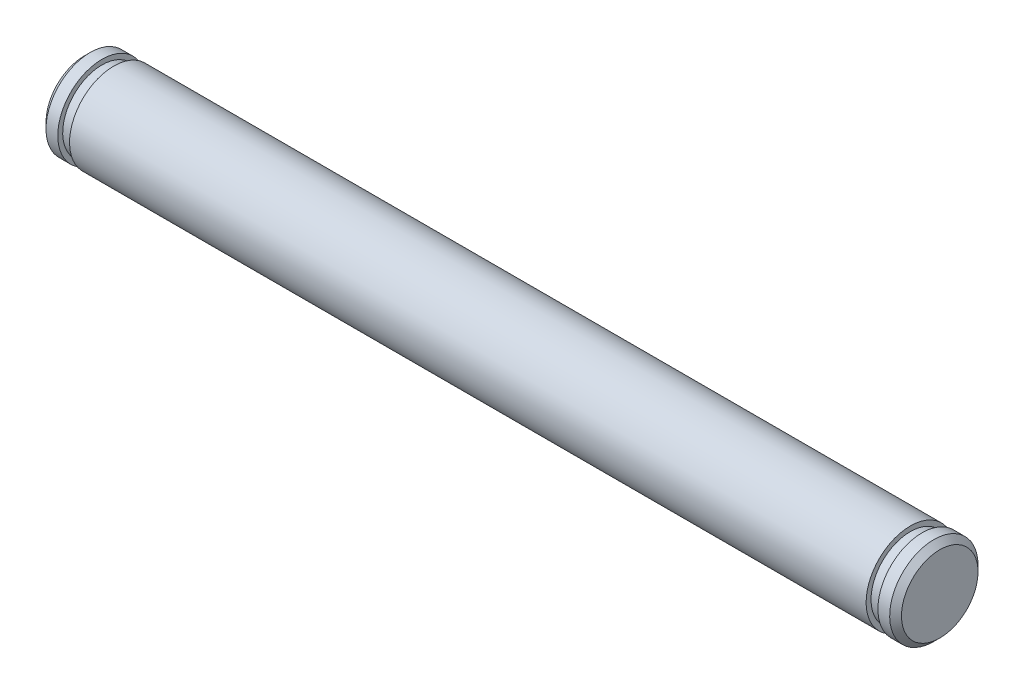
ISO-10303-21;
HEADER;
FILE_DESCRIPTION(('STEP AP214'),'2;1');
FILE_NAME('part.step','',(''),(''),'','','');
FILE_SCHEMA(('AUTOMOTIVE_DESIGN { 1 0 10303 214 1 1 1 1 }'));
ENDSEC;
DATA;
#1=APPLICATION_CONTEXT('core data for automotive mechanical design processes');
#2=APPLICATION_PROTOCOL_DEFINITION('international standard','automotive_design',2000,#1);
#3=PRODUCT_CONTEXT('',#1,'mechanical');
#4=PRODUCT('Part','Part','',(#3));
#5=PRODUCT_RELATED_PRODUCT_CATEGORY('part','',(#4));
#6=PRODUCT_DEFINITION_FORMATION('','',#4);
#7=PRODUCT_DEFINITION_CONTEXT('part definition',#1,'design');
#8=PRODUCT_DEFINITION('design','',#6,#7);
#9=PRODUCT_DEFINITION_SHAPE('','',#8);
#10=(LENGTH_UNIT() NAMED_UNIT(*) SI_UNIT(.MILLI.,.METRE.));
#11=(NAMED_UNIT(*) PLANE_ANGLE_UNIT() SI_UNIT($,.RADIAN.));
#12=(NAMED_UNIT(*) SI_UNIT($,.STERADIAN.) SOLID_ANGLE_UNIT());
#13=UNCERTAINTY_MEASURE_WITH_UNIT(LENGTH_MEASURE(1.E-05),#10,'distance_accuracy_value','');
#14=(GEOMETRIC_REPRESENTATION_CONTEXT(3) GLOBAL_UNCERTAINTY_ASSIGNED_CONTEXT((#13)) GLOBAL_UNIT_ASSIGNED_CONTEXT((#10,
#11,#12)) REPRESENTATION_CONTEXT('',''));
#15=CARTESIAN_POINT('',(0.,0.,0.));
#16=DIRECTION('',(0.,0.,1.));
#17=DIRECTION('',(1.,0.,0.));
#18=AXIS2_PLACEMENT_3D('',#15,#16,#17);
#19=CARTESIAN_POINT('',(-2.,0.,0.));
#20=DIRECTION('',(-1.,0.,0.));
#21=DIRECTION('',(0.,-1.,0.));
#22=AXIS2_PLACEMENT_3D('',#19,#20,#21);
#23=PLANE('',#22);
#24=CARTESIAN_POINT('',(-2.,0.,0.));
#25=DIRECTION('',(-1.,0.,0.));
#26=DIRECTION('',(0.,-1.,0.));
#27=AXIS2_PLACEMENT_3D('',#24,#25,#26);
#28=CIRCLE('',#27,2.59999999999998);
#29=CARTESIAN_POINT('',(-2.,-2.59999999999998,0.));
#30=VERTEX_POINT('',#29);
#31=EDGE_CURVE('E56',#30,#30,#28,.T.);
#32=ORIENTED_EDGE('',*,*,#31,.T.);
#33=EDGE_LOOP('',(#32));
#34=FACE_BOUND('',#33,.T.);
#35=ADVANCED_FACE('F45',(#34),#23,.T.);
#36=CARTESIAN_POINT('',(-2.,0.,0.));
#37=DIRECTION('',(1.,0.,0.));
#38=DIRECTION('',(0.,1.,0.));
#39=AXIS2_PLACEMENT_3D('',#36,#37,#38);
#40=CYLINDRICAL_SURFACE('',#39,3.);
#41=CARTESIAN_POINT('',(-1.59999999999999,0.,0.));
#42=DIRECTION('',(-1.,0.,0.));
#43=DIRECTION('',(0.,-1.,0.));
#44=AXIS2_PLACEMENT_3D('',#41,#42,#43);
#45=CIRCLE('',#44,3.);
#46=CARTESIAN_POINT('',(-1.59999999999999,-3.,0.));
#47=VERTEX_POINT('',#46);
#48=EDGE_CURVE('E60',#47,#47,#45,.F.);
#49=ORIENTED_EDGE('',*,*,#48,.T.);
#50=EDGE_LOOP('',(#49));
#51=FACE_BOUND('',#50,.T.);
#52=CARTESIAN_POINT('',(-0.800000000000001,0.,0.));
#53=DIRECTION('',(1.,0.,0.));
#54=DIRECTION('',(0.,1.,0.));
#55=AXIS2_PLACEMENT_3D('',#52,#53,#54);
#56=CIRCLE('',#55,3.);
#57=CARTESIAN_POINT('',(-0.800000000000001,3.,0.));
#58=VERTEX_POINT('',#57);
#59=EDGE_CURVE('E65',#58,#58,#56,.T.);
#60=ORIENTED_EDGE('',*,*,#59,.F.);
#61=EDGE_LOOP('',(#60));
#62=FACE_BOUND('',#61,.T.);
#63=ADVANCED_FACE('F107',(#51,#62),#40,.T.);
#64=CARTESIAN_POINT('',(-0.800000000000001,3.,0.));
#65=DIRECTION('',(1.,0.,0.));
#66=DIRECTION('',(0.,1.,0.));
#67=AXIS2_PLACEMENT_3D('',#64,#65,#66);
#68=PLANE('',#67);
#69=ORIENTED_EDGE('',*,*,#59,.T.);
#70=EDGE_LOOP('',(#69));
#71=FACE_BOUND('',#70,.T.);
#72=CARTESIAN_POINT('',(-0.800000000000001,0.,0.));
#73=DIRECTION('',(1.,0.,0.));
#74=DIRECTION('',(0.,1.,0.));
#75=AXIS2_PLACEMENT_3D('',#72,#73,#74);
#76=CIRCLE('',#75,2.667);
#77=CARTESIAN_POINT('',(-0.800000000000001,2.667,0.));
#78=VERTEX_POINT('',#77);
#79=EDGE_CURVE('E68',#78,#78,#76,.T.);
#80=ORIENTED_EDGE('',*,*,#79,.F.);
#81=EDGE_LOOP('',(#80));
#82=FACE_BOUND('',#81,.T.);
#83=ADVANCED_FACE('F113',(#71,#82),#68,.T.);
#84=CARTESIAN_POINT('',(-2.,0.,0.));
#85=DIRECTION('',(1.,0.,0.));
#86=DIRECTION('',(0.,1.,0.));
#87=AXIS2_PLACEMENT_3D('',#84,#85,#86);
#88=CYLINDRICAL_SURFACE('',#87,2.667);
#89=ORIENTED_EDGE('',*,*,#79,.T.);
#90=EDGE_LOOP('',(#89));
#91=FACE_BOUND('',#90,.T.);
#92=CARTESIAN_POINT('',(0.,0.,0.));
#93=DIRECTION('',(1.,0.,0.));
#94=DIRECTION('',(0.,1.,0.));
#95=AXIS2_PLACEMENT_3D('',#92,#93,#94);
#96=CIRCLE('',#95,2.667);
#97=CARTESIAN_POINT('',(0.,2.667,0.));
#98=VERTEX_POINT('',#97);
#99=EDGE_CURVE('E71',#98,#98,#96,.T.);
#100=ORIENTED_EDGE('',*,*,#99,.F.);
#101=EDGE_LOOP('',(#100));
#102=FACE_BOUND('',#101,.T.);
#103=ADVANCED_FACE('F134',(#91,#102),#88,.T.);
#104=CARTESIAN_POINT('',(0.,3.,0.));
#105=DIRECTION('',(-1.,0.,0.));
#106=DIRECTION('',(0.,-1.,0.));
#107=AXIS2_PLACEMENT_3D('',#104,#105,#106);
#108=PLANE('',#107);
#109=ORIENTED_EDGE('',*,*,#99,.T.);
#110=EDGE_LOOP('',(#109));
#111=FACE_BOUND('',#110,.T.);
#112=CARTESIAN_POINT('',(0.,0.,0.));
#113=DIRECTION('',(1.,0.,0.));
#114=DIRECTION('',(0.,1.,0.));
#115=AXIS2_PLACEMENT_3D('',#112,#113,#114);
#116=CIRCLE('',#115,3.);
#117=CARTESIAN_POINT('',(0.,3.,0.));
#118=VERTEX_POINT('',#117);
#119=EDGE_CURVE('E74',#118,#118,#116,.T.);
#120=ORIENTED_EDGE('',*,*,#119,.F.);
#121=EDGE_LOOP('',(#120));
#122=FACE_BOUND('',#121,.T.);
#123=ADVANCED_FACE('F139',(#111,#122),#108,.T.);
#124=CARTESIAN_POINT('',(-2.,0.,0.));
#125=DIRECTION('',(1.,0.,0.));
#126=DIRECTION('',(0.,1.,0.));
#127=AXIS2_PLACEMENT_3D('',#124,#125,#126);
#128=CYLINDRICAL_SURFACE('',#127,3.);
#129=ORIENTED_EDGE('',*,*,#119,.T.);
#130=EDGE_LOOP('',(#129));
#131=FACE_BOUND('',#130,.T.);
#132=CARTESIAN_POINT('',(54.102,0.,0.));
#133=DIRECTION('',(1.,0.,0.));
#134=DIRECTION('',(0.,1.,0.));
#135=AXIS2_PLACEMENT_3D('',#132,#133,#134);
#136=CIRCLE('',#135,3.);
#137=CARTESIAN_POINT('',(54.102,3.,0.));
#138=VERTEX_POINT('',#137);
#139=EDGE_CURVE('E77',#138,#138,#136,.T.);
#140=ORIENTED_EDGE('',*,*,#139,.F.);
#141=EDGE_LOOP('',(#140));
#142=FACE_BOUND('',#141,.T.);
#143=ADVANCED_FACE('F145',(#131,#142),#128,.T.);
#144=CARTESIAN_POINT('',(54.102,3.,0.));
#145=DIRECTION('',(1.,0.,0.));
#146=DIRECTION('',(0.,1.,0.));
#147=AXIS2_PLACEMENT_3D('',#144,#145,#146);
#148=PLANE('',#147);
#149=ORIENTED_EDGE('',*,*,#139,.T.);
#150=EDGE_LOOP('',(#149));
#151=FACE_BOUND('',#150,.T.);
#152=CARTESIAN_POINT('',(54.102,0.,0.));
#153=DIRECTION('',(1.,0.,0.));
#154=DIRECTION('',(0.,1.,0.));
#155=AXIS2_PLACEMENT_3D('',#152,#153,#154);
#156=CIRCLE('',#155,2.667);
#157=CARTESIAN_POINT('',(54.102,2.667,0.));
#158=VERTEX_POINT('',#157);
#159=EDGE_CURVE('E80',#158,#158,#156,.T.);
#160=ORIENTED_EDGE('',*,*,#159,.F.);
#161=EDGE_LOOP('',(#160));
#162=FACE_BOUND('',#161,.T.);
#163=ADVANCED_FACE('F103',(#151,#162),#148,.T.);
#164=CARTESIAN_POINT('',(-2.,0.,0.));
#165=DIRECTION('',(1.,0.,0.));
#166=DIRECTION('',(0.,1.,0.));
#167=AXIS2_PLACEMENT_3D('',#164,#165,#166);
#168=CYLINDRICAL_SURFACE('',#167,2.667);
#169=ORIENTED_EDGE('',*,*,#159,.T.);
#170=EDGE_LOOP('',(#169));
#171=FACE_BOUND('',#170,.T.);
#172=CARTESIAN_POINT('',(54.902,0.,0.));
#173=DIRECTION('',(1.,0.,0.));
#174=DIRECTION('',(0.,1.,0.));
#175=AXIS2_PLACEMENT_3D('',#172,#173,#174);
#176=CIRCLE('',#175,2.667);
#177=CARTESIAN_POINT('',(54.902,2.667,0.));
#178=VERTEX_POINT('',#177);
#179=EDGE_CURVE('E83',#178,#178,#176,.T.);
#180=ORIENTED_EDGE('',*,*,#179,.F.);
#181=EDGE_LOOP('',(#180));
#182=FACE_BOUND('',#181,.T.);
#183=ADVANCED_FACE('F94',(#171,#182),#168,.T.);
#184=CARTESIAN_POINT('',(54.902,3.,0.));
#185=DIRECTION('',(-1.,0.,0.));
#186=DIRECTION('',(0.,-1.,0.));
#187=AXIS2_PLACEMENT_3D('',#184,#185,#186);
#188=PLANE('',#187);
#189=ORIENTED_EDGE('',*,*,#179,.T.);
#190=EDGE_LOOP('',(#189));
#191=FACE_BOUND('',#190,.T.);
#192=CARTESIAN_POINT('',(54.902,0.,0.));
#193=DIRECTION('',(1.,0.,0.));
#194=DIRECTION('',(0.,1.,0.));
#195=AXIS2_PLACEMENT_3D('',#192,#193,#194);
#196=CIRCLE('',#195,3.);
#197=CARTESIAN_POINT('',(54.902,3.,0.));
#198=VERTEX_POINT('',#197);
#199=EDGE_CURVE('E86',#198,#198,#196,.T.);
#200=ORIENTED_EDGE('',*,*,#199,.F.);
#201=EDGE_LOOP('',(#200));
#202=FACE_BOUND('',#201,.T.);
#203=ADVANCED_FACE('F92',(#191,#202),#188,.T.);
#204=CARTESIAN_POINT('',(-2.,0.,0.));
#205=DIRECTION('',(1.,0.,0.));
#206=DIRECTION('',(0.,1.,0.));
#207=AXIS2_PLACEMENT_3D('',#204,#205,#206);
#208=CYLINDRICAL_SURFACE('',#207,3.);
#209=CARTESIAN_POINT('',(55.702,0.,0.));
#210=DIRECTION('',(1.,0.,0.));
#211=DIRECTION('',(0.,1.,0.));
#212=AXIS2_PLACEMENT_3D('',#209,#210,#211);
#213=CIRCLE('',#212,3.);
#214=CARTESIAN_POINT('',(55.702,3.,0.));
#215=VERTEX_POINT('',#214);
#216=EDGE_CURVE('E12',#215,#215,#213,.F.);
#217=ORIENTED_EDGE('',*,*,#216,.T.);
#218=EDGE_LOOP('',(#217));
#219=FACE_BOUND('',#218,.T.);
#220=ORIENTED_EDGE('',*,*,#199,.T.);
#221=EDGE_LOOP('',(#220));
#222=FACE_BOUND('',#221,.T.);
#223=ADVANCED_FACE('F90',(#219,#222),#208,.T.);
#224=CARTESIAN_POINT('',(56.102,0.,0.));
#225=DIRECTION('',(1.,0.,0.));
#226=DIRECTION('',(0.,1.,0.));
#227=AXIS2_PLACEMENT_3D('',#224,#225,#226);
#228=PLANE('',#227);
#229=CARTESIAN_POINT('',(56.102,0.,0.));
#230=DIRECTION('',(1.,0.,0.));
#231=DIRECTION('',(0.,1.,0.));
#232=AXIS2_PLACEMENT_3D('',#229,#230,#231);
#233=CIRCLE('',#232,2.6);
#234=CARTESIAN_POINT('',(56.102,2.6,0.));
#235=VERTEX_POINT('',#234);
#236=EDGE_CURVE('E52',#235,#235,#233,.T.);
#237=ORIENTED_EDGE('',*,*,#236,.T.);
#238=EDGE_LOOP('',(#237));
#239=FACE_BOUND('',#238,.T.);
#240=ADVANCED_FACE('F101',(#239),#228,.T.);
#241=CARTESIAN_POINT('',(-1.59999999999999,0.,0.));
#242=DIRECTION('',(1.,0.,0.));
#243=DIRECTION('',(0.,1.,0.));
#244=AXIS2_PLACEMENT_3D('',#241,#242,#243);
#245=CONICAL_SURFACE('',#244,3.,0.78539816339746);
#246=ORIENTED_EDGE('',*,*,#31,.F.);
#247=EDGE_LOOP('',(#246));
#248=FACE_BOUND('',#247,.T.);
#249=ORIENTED_EDGE('',*,*,#48,.F.);
#250=EDGE_LOOP('',(#249));
#251=FACE_BOUND('',#250,.T.);
#252=ADVANCED_FACE('F117',(#248,#251),#245,.T.);
#253=CARTESIAN_POINT('',(56.102,0.,0.));
#254=DIRECTION('',(-1.,0.,0.));
#255=DIRECTION('',(0.,-1.,0.));
#256=AXIS2_PLACEMENT_3D('',#253,#254,#255);
#257=CONICAL_SURFACE('',#256,2.6,0.785398163397445);
#258=ORIENTED_EDGE('',*,*,#216,.F.);
#259=EDGE_LOOP('',(#258));
#260=FACE_BOUND('',#259,.T.);
#261=ORIENTED_EDGE('',*,*,#236,.F.);
#262=EDGE_LOOP('',(#261));
#263=FACE_BOUND('',#262,.T.);
#264=ADVANCED_FACE('F47',(#260,#263),#257,.T.);
#265=CLOSED_SHELL('',(#35,#63,#83,#103,#123,#143,#163,#183,#203,#223,#240,#252,#264));
#266=MANIFOLD_SOLID_BREP('B2',#265);
#267=ADVANCED_BREP_SHAPE_REPRESENTATION('',(#18,#266),#14);
#268=SHAPE_DEFINITION_REPRESENTATION(#9,#267);
ENDSEC;
END-ISO-10303-21;
